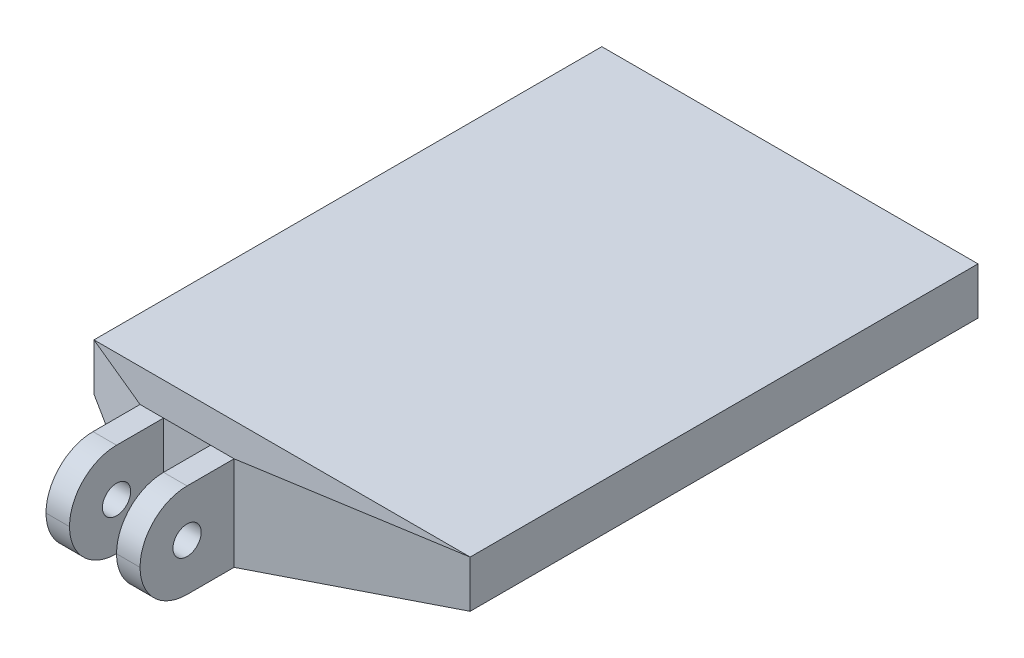
ISO-10303-21;
HEADER;
FILE_DESCRIPTION(('STEP AP214'),'2;1');
FILE_NAME('part.step','',(''),(''),'','','');
FILE_SCHEMA(('AUTOMOTIVE_DESIGN { 1 0 10303 214 1 1 1 1 }'));
ENDSEC;
DATA;
#1=APPLICATION_CONTEXT('core data for automotive mechanical design processes');
#2=APPLICATION_PROTOCOL_DEFINITION('international standard','automotive_design',2000,#1);
#3=PRODUCT_CONTEXT('',#1,'mechanical');
#4=PRODUCT('Part','Part','',(#3));
#5=PRODUCT_RELATED_PRODUCT_CATEGORY('part','',(#4));
#6=PRODUCT_DEFINITION_FORMATION('','',#4);
#7=PRODUCT_DEFINITION_CONTEXT('part definition',#1,'design');
#8=PRODUCT_DEFINITION('design','',#6,#7);
#9=PRODUCT_DEFINITION_SHAPE('','',#8);
#10=(LENGTH_UNIT() NAMED_UNIT(*) SI_UNIT(.MILLI.,.METRE.));
#11=(NAMED_UNIT(*) PLANE_ANGLE_UNIT() SI_UNIT($,.RADIAN.));
#12=(NAMED_UNIT(*) SI_UNIT($,.STERADIAN.) SOLID_ANGLE_UNIT());
#13=UNCERTAINTY_MEASURE_WITH_UNIT(LENGTH_MEASURE(1.E-05),#10,'distance_accuracy_value','');
#14=(GEOMETRIC_REPRESENTATION_CONTEXT(3) GLOBAL_UNCERTAINTY_ASSIGNED_CONTEXT((#13)) GLOBAL_UNIT_ASSIGNED_CONTEXT((#10,
#11,#12)) REPRESENTATION_CONTEXT('',''));
#15=CARTESIAN_POINT('',(0.,0.,0.));
#16=DIRECTION('',(0.,0.,1.));
#17=DIRECTION('',(1.,0.,0.));
#18=AXIS2_PLACEMENT_3D('',#15,#16,#17);
#19=CARTESIAN_POINT('',(0.,0.,31.));
#20=DIRECTION('',(0.,0.,1.));
#21=DIRECTION('',(1.,0.,0.));
#22=AXIS2_PLACEMENT_3D('',#19,#20,#21);
#23=PLANE('',#22);
#24=DIRECTION('',(1.,0.,0.));
#25=VECTOR('',#24,1.);
#26=CARTESIAN_POINT('',(-4.55,-2.5,31.));
#27=LINE('',#26,#25);
#28=CARTESIAN_POINT('',(-3.3,-2.5,31.));
#29=VERTEX_POINT('',#28);
#30=CARTESIAN_POINT('',(-0.800000000000001,-2.5,31.));
#31=VERTEX_POINT('',#30);
#32=EDGE_CURVE('E211',#29,#31,#27,.T.);
#33=ORIENTED_EDGE('',*,*,#32,.T.);
#34=DIRECTION('',(0.,-1.,0.));
#35=VECTOR('',#34,1.);
#36=CARTESIAN_POINT('',(-0.8,2.5,31.));
#37=LINE('',#36,#35);
#38=CARTESIAN_POINT('',(-0.800000000000001,2.5,31.));
#39=VERTEX_POINT('',#38);
#40=EDGE_CURVE('E218',#39,#31,#37,.T.);
#41=ORIENTED_EDGE('',*,*,#40,.F.);
#42=DIRECTION('',(-1.,0.,0.));
#43=VECTOR('',#42,1.);
#44=CARTESIAN_POINT('',(-4.55,2.5,31.));
#45=LINE('',#44,#43);
#46=CARTESIAN_POINT('',(-3.3,2.5,31.));
#47=VERTEX_POINT('',#46);
#48=EDGE_CURVE('E312',#39,#47,#45,.T.);
#49=ORIENTED_EDGE('',*,*,#48,.T.);
#50=DIRECTION('',(0.,1.,0.));
#51=VECTOR('',#50,1.);
#52=CARTESIAN_POINT('',(-3.3,2.5,31.));
#53=LINE('',#52,#51);
#54=EDGE_CURVE('E396',#29,#47,#53,.T.);
#55=ORIENTED_EDGE('',*,*,#54,.F.);
#56=EDGE_LOOP('',(#33,#41,#49,#55));
#57=FACE_BOUND('',#56,.T.);
#58=ADVANCED_FACE('F55',(#57),#23,.T.);
#59=CARTESIAN_POINT('',(10.,-1.25,28.));
#60=DIRECTION('',(-1.,0.,0.));
#61=DIRECTION('',(0.,0.,1.));
#62=AXIS2_PLACEMENT_3D('',#59,#60,#61);
#63=PLANE('',#62);
#64=DIRECTION('',(0.,0.,-1.));
#65=VECTOR('',#64,1.);
#66=CARTESIAN_POINT('',(10.,-1.25,28.));
#67=LINE('',#66,#65);
#68=CARTESIAN_POINT('',(10.,-1.25,28.));
#69=VERTEX_POINT('',#68);
#70=CARTESIAN_POINT('',(10.,-1.25,1.));
#71=VERTEX_POINT('',#70);
#72=EDGE_CURVE('E378',#69,#71,#67,.T.);
#73=ORIENTED_EDGE('',*,*,#72,.T.);
#74=DIRECTION('',(0.,1.,0.));
#75=VECTOR('',#74,1.);
#76=CARTESIAN_POINT('',(10.,1.25,1.));
#77=LINE('',#76,#75);
#78=CARTESIAN_POINT('',(10.,1.25,1.));
#79=VERTEX_POINT('',#78);
#80=EDGE_CURVE('E12',#71,#79,#77,.T.);
#81=ORIENTED_EDGE('',*,*,#80,.T.);
#82=DIRECTION('',(0.,0.,-1.));
#83=VECTOR('',#82,1.);
#84=CARTESIAN_POINT('',(10.,1.25,28.));
#85=LINE('',#84,#83);
#86=CARTESIAN_POINT('',(9.99999999999999,1.25,28.));
#87=VERTEX_POINT('',#86);
#88=EDGE_CURVE('E435',#87,#79,#85,.T.);
#89=ORIENTED_EDGE('',*,*,#88,.F.);
#90=DIRECTION('',(0.,1.,0.));
#91=VECTOR('',#90,1.);
#92=CARTESIAN_POINT('',(10.,0.,28.));
#93=LINE('',#92,#91);
#94=EDGE_CURVE('E538',#69,#87,#93,.T.);
#95=ORIENTED_EDGE('',*,*,#94,.F.);
#96=EDGE_LOOP('',(#73,#81,#89,#95));
#97=FACE_BOUND('',#96,.T.);
#98=ADVANCED_FACE('F361',(#97),#63,.F.);
#99=CARTESIAN_POINT('',(-10.,1.25,28.));
#100=DIRECTION('',(0.,-1.,0.));
#101=DIRECTION('',(0.,0.,-1.));
#102=AXIS2_PLACEMENT_3D('',#99,#100,#101);
#103=PLANE('',#102);
#104=ORIENTED_EDGE('',*,*,#88,.T.);
#105=DIRECTION('',(-1.,0.,0.));
#106=VECTOR('',#105,1.);
#107=CARTESIAN_POINT('',(-10.,1.25,1.));
#108=LINE('',#107,#106);
#109=CARTESIAN_POINT('',(-10.,1.25,1.));
#110=VERTEX_POINT('',#109);
#111=EDGE_CURVE('E567',#79,#110,#108,.T.);
#112=ORIENTED_EDGE('',*,*,#111,.T.);
#113=DIRECTION('',(0.,0.,-1.));
#114=VECTOR('',#113,1.);
#115=CARTESIAN_POINT('',(-10.,1.25,28.));
#116=LINE('',#115,#114);
#117=CARTESIAN_POINT('',(-9.99999999999999,1.25,28.));
#118=VERTEX_POINT('',#117);
#119=EDGE_CURVE('E441',#118,#110,#116,.T.);
#120=ORIENTED_EDGE('',*,*,#119,.F.);
#121=DIRECTION('',(1.,0.,0.));
#122=VECTOR('',#121,1.);
#123=CARTESIAN_POINT('',(0.,1.25,28.));
#124=LINE('',#123,#122);
#125=EDGE_CURVE('E536',#87,#118,#124,.F.);
#126=ORIENTED_EDGE('',*,*,#125,.F.);
#127=EDGE_LOOP('',(#104,#112,#120,#126));
#128=FACE_BOUND('',#127,.T.);
#129=ADVANCED_FACE('F366',(#128),#103,.F.);
#130=CARTESIAN_POINT('',(-10.,-1.25,28.));
#131=DIRECTION('',(1.,0.,0.));
#132=DIRECTION('',(0.,0.,-1.));
#133=AXIS2_PLACEMENT_3D('',#130,#131,#132);
#134=PLANE('',#133);
#135=ORIENTED_EDGE('',*,*,#119,.T.);
#136=DIRECTION('',(0.,-1.,0.));
#137=VECTOR('',#136,1.);
#138=CARTESIAN_POINT('',(-10.,-1.25,1.));
#139=LINE('',#138,#137);
#140=CARTESIAN_POINT('',(-10.,-1.25,1.));
#141=VERTEX_POINT('',#140);
#142=EDGE_CURVE('E81',#110,#141,#139,.T.);
#143=ORIENTED_EDGE('',*,*,#142,.T.);
#144=DIRECTION('',(0.,0.,-1.));
#145=VECTOR('',#144,1.);
#146=CARTESIAN_POINT('',(-10.,-1.25,28.));
#147=LINE('',#146,#145);
#148=CARTESIAN_POINT('',(-10.,-1.25,28.));
#149=VERTEX_POINT('',#148);
#150=EDGE_CURVE('E558',#149,#141,#147,.T.);
#151=ORIENTED_EDGE('',*,*,#150,.F.);
#152=DIRECTION('',(0.,1.,0.));
#153=VECTOR('',#152,1.);
#154=CARTESIAN_POINT('',(-10.,0.,28.));
#155=LINE('',#154,#153);
#156=EDGE_CURVE('E552',#118,#149,#155,.F.);
#157=ORIENTED_EDGE('',*,*,#156,.F.);
#158=EDGE_LOOP('',(#135,#143,#151,#157));
#159=FACE_BOUND('',#158,.T.);
#160=ADVANCED_FACE('F562',(#159),#134,.F.);
#161=CARTESIAN_POINT('',(-10.,-1.25,28.));
#162=DIRECTION('',(0.,1.,0.));
#163=DIRECTION('',(0.,0.,1.));
#164=AXIS2_PLACEMENT_3D('',#161,#162,#163);
#165=PLANE('',#164);
#166=ORIENTED_EDGE('',*,*,#150,.T.);
#167=DIRECTION('',(1.,0.,0.));
#168=VECTOR('',#167,1.);
#169=CARTESIAN_POINT('',(10.,-1.25,1.));
#170=LINE('',#169,#168);
#171=EDGE_CURVE('E66',#141,#71,#170,.T.);
#172=ORIENTED_EDGE('',*,*,#171,.T.);
#173=ORIENTED_EDGE('',*,*,#72,.F.);
#174=DIRECTION('',(1.,0.,0.));
#175=VECTOR('',#174,1.);
#176=CARTESIAN_POINT('',(0.,-1.25,28.));
#177=LINE('',#176,#175);
#178=EDGE_CURVE('E199',#149,#69,#177,.T.);
#179=ORIENTED_EDGE('',*,*,#178,.F.);
#180=EDGE_LOOP('',(#166,#172,#173,#179));
#181=FACE_BOUND('',#180,.T.);
#182=ADVANCED_FACE('F792',(#181),#165,.F.);
#183=CARTESIAN_POINT('',(0.,0.,0.));
#184=DIRECTION('',(0.,0.,-1.));
#185=DIRECTION('',(-1.,0.,0.));
#186=AXIS2_PLACEMENT_3D('',#183,#184,#185);
#187=PLANE('',#186);
#188=DIRECTION('',(0.,1.,0.));
#189=VECTOR('',#188,1.);
#190=CARTESIAN_POINT('',(-8.99999999999999,1.25,0.));
#191=LINE('',#190,#189);
#192=CARTESIAN_POINT('',(-8.99999999999999,-0.249999999999992,0.));
#193=VERTEX_POINT('',#192);
#194=CARTESIAN_POINT('',(-8.99999999999999,0.249999999999992,0.));
#195=VERTEX_POINT('',#194);
#196=EDGE_CURVE('E585',#193,#195,#191,.T.);
#197=ORIENTED_EDGE('',*,*,#196,.T.);
#198=DIRECTION('',(1.,0.,0.));
#199=VECTOR('',#198,1.);
#200=CARTESIAN_POINT('',(10.,0.249999999999992,0.));
#201=LINE('',#200,#199);
#202=CARTESIAN_POINT('',(8.99999999999999,0.249999999999992,0.));
#203=VERTEX_POINT('',#202);
#204=EDGE_CURVE('E588',#195,#203,#201,.T.);
#205=ORIENTED_EDGE('',*,*,#204,.T.);
#206=DIRECTION('',(0.,-1.,0.));
#207=VECTOR('',#206,1.);
#208=CARTESIAN_POINT('',(8.99999999999999,-1.25,0.));
#209=LINE('',#208,#207);
#210=CARTESIAN_POINT('',(8.99999999999999,-0.249999999999992,0.));
#211=VERTEX_POINT('',#210);
#212=EDGE_CURVE('E571',#203,#211,#209,.T.);
#213=ORIENTED_EDGE('',*,*,#212,.T.);
#214=DIRECTION('',(-1.,0.,0.));
#215=VECTOR('',#214,1.);
#216=CARTESIAN_POINT('',(-10.,-0.249999999999992,0.));
#217=LINE('',#216,#215);
#218=EDGE_CURVE('E575',#211,#193,#217,.T.);
#219=ORIENTED_EDGE('',*,*,#218,.T.);
#220=EDGE_LOOP('',(#197,#205,#213,#219));
#221=FACE_BOUND('',#220,.T.);
#222=ADVANCED_FACE('F292',(#221),#187,.T.);
#223=CARTESIAN_POINT('',(8.90396946183977,0.,28.3443027868566));
#224=DIRECTION('',(0.299696710543211,0.,0.954034528562556));
#225=DIRECTION('',(0.954034528562556,0.,-0.299696710543211));
#226=AXIS2_PLACEMENT_3D('',#223,#224,#225);
#227=PLANE('',#226);
#228=DIRECTION('',(0.946682073020697,0.123911266102185,-0.297387038645245));
#229=VECTOR('',#228,1.);
#230=CARTESIAN_POINT('',(0.450000000000001,-2.5,31.));
#231=LINE('',#230,#229);
#232=CARTESIAN_POINT('',(0.450000000000001,-2.5,31.));
#233=VERTEX_POINT('',#232);
#234=EDGE_CURVE('E192',#233,#69,#231,.T.);
#235=ORIENTED_EDGE('',*,*,#234,.T.);
#236=ORIENTED_EDGE('',*,*,#94,.T.);
#237=DIRECTION('',(0.946682073020697,-0.123911266102185,-0.297387038645245));
#238=VECTOR('',#237,1.);
#239=CARTESIAN_POINT('',(0.45,2.5,31.));
#240=LINE('',#239,#238);
#241=CARTESIAN_POINT('',(0.45,2.5,31.));
#242=VERTEX_POINT('',#241);
#243=EDGE_CURVE('E203',#242,#87,#240,.T.);
#244=ORIENTED_EDGE('',*,*,#243,.F.);
#245=DIRECTION('',(0.,1.,0.));
#246=VECTOR('',#245,1.);
#247=CARTESIAN_POINT('',(0.45,2.5,31.));
#248=LINE('',#247,#246);
#249=EDGE_CURVE('E177',#233,#242,#248,.T.);
#250=ORIENTED_EDGE('',*,*,#249,.F.);
#251=EDGE_LOOP('',(#235,#236,#244,#250));
#252=FACE_BOUND('',#251,.T.);
#253=ADVANCED_FACE('F207',(#252),#227,.T.);
#254=CARTESIAN_POINT('',(0.,-8.87573964497042,3.69822485207101));
#255=DIRECTION('',(0.,0.923076923076923,-0.384615384615385));
#256=DIRECTION('',(0.,0.384615384615385,0.923076923076923));
#257=AXIS2_PLACEMENT_3D('',#254,#255,#256);
#258=PLANE('',#257);
#259=ORIENTED_EDGE('',*,*,#243,.T.);
#260=ORIENTED_EDGE('',*,*,#125,.T.);
#261=DIRECTION('',(-0.858880317897595,-0.196990898600366,-0.472778156640878));
#262=VECTOR('',#261,1.);
#263=CARTESIAN_POINT('',(-4.55,2.5,31.));
#264=LINE('',#263,#262);
#265=CARTESIAN_POINT('',(-4.55,2.5,31.));
#266=VERTEX_POINT('',#265);
#267=EDGE_CURVE('E534',#266,#118,#264,.T.);
#268=ORIENTED_EDGE('',*,*,#267,.F.);
#269=CARTESIAN_POINT('',(-3.3,2.5,31.));
#270=DIRECTION('',(-1.,0.,0.));
#271=VECTOR('',#270,1.);
#272=LINE('',#269,#271);
#273=EDGE_CURVE('E401',#47,#266,#272,.T.);
#274=ORIENTED_EDGE('',*,*,#273,.F.);
#275=ORIENTED_EDGE('',*,*,#48,.F.);
#276=EDGE_CURVE('E204',#242,#39,#45,.T.);
#277=ORIENTED_EDGE('',*,*,#276,.F.);
#278=EDGE_LOOP('',(#259,#260,#268,#274,#275,#277));
#279=FACE_BOUND('',#278,.T.);
#280=ADVANCED_FACE('F284',(#279),#258,.T.);
#281=CARTESIAN_POINT('',(0.,8.87573964497042,3.69822485207101));
#282=DIRECTION('',(0.,-0.923076923076923,-0.384615384615385));
#283=DIRECTION('',(0.,0.384615384615385,-0.923076923076923));
#284=AXIS2_PLACEMENT_3D('',#281,#282,#283);
#285=PLANE('',#284);
#286=DIRECTION('',(-0.858880317897595,0.196990898600366,-0.472778156640878));
#287=VECTOR('',#286,1.);
#288=CARTESIAN_POINT('',(-4.55,-2.5,31.));
#289=LINE('',#288,#287);
#290=CARTESIAN_POINT('',(-4.55,-2.5,31.));
#291=VERTEX_POINT('',#290);
#292=EDGE_CURVE('E270',#291,#149,#289,.T.);
#293=ORIENTED_EDGE('',*,*,#292,.T.);
#294=ORIENTED_EDGE('',*,*,#178,.T.);
#295=ORIENTED_EDGE('',*,*,#234,.F.);
#296=CARTESIAN_POINT('',(-0.8,-2.5,31.));
#297=DIRECTION('',(1.,0.,0.));
#298=VECTOR('',#297,1.);
#299=LINE('',#296,#298);
#300=EDGE_CURVE('E185',#31,#233,#299,.T.);
#301=ORIENTED_EDGE('',*,*,#300,.F.);
#302=ORIENTED_EDGE('',*,*,#32,.F.);
#303=EDGE_CURVE('E475',#291,#29,#27,.T.);
#304=ORIENTED_EDGE('',*,*,#303,.F.);
#305=EDGE_LOOP('',(#293,#294,#295,#301,#302,#304));
#306=FACE_BOUND('',#305,.T.);
#307=ADVANCED_FACE('F194',(#306),#285,.T.);
#308=CARTESIAN_POINT('',(-14.1541244105678,0.,25.7133260125315));
#309=DIRECTION('',(-0.482227246606493,0.,0.876046164668461));
#310=DIRECTION('',(0.876046164668461,0.,0.482227246606493));
#311=AXIS2_PLACEMENT_3D('',#308,#309,#310);
#312=PLANE('',#311);
#313=ORIENTED_EDGE('',*,*,#267,.T.);
#314=ORIENTED_EDGE('',*,*,#156,.T.);
#315=ORIENTED_EDGE('',*,*,#292,.F.);
#316=DIRECTION('',(0.,-1.,0.));
#317=VECTOR('',#316,1.);
#318=CARTESIAN_POINT('',(-4.55,2.5,31.));
#319=LINE('',#318,#317);
#320=EDGE_CURVE('E424',#266,#291,#319,.T.);
#321=ORIENTED_EDGE('',*,*,#320,.F.);
#322=EDGE_LOOP('',(#313,#314,#315,#321));
#323=FACE_BOUND('',#322,.T.);
#324=ADVANCED_FACE('F283',(#323),#312,.T.);
#325=CARTESIAN_POINT('',(-4.55,2.5,36.));
#326=DIRECTION('',(1.,0.,0.));
#327=DIRECTION('',(0.,1.,0.));
#328=AXIS2_PLACEMENT_3D('',#325,#326,#327);
#329=PLANE('',#328);
#330=CARTESIAN_POINT('',(-4.55,0.,33.5));
#331=DIRECTION('',(1.,0.,0.));
#332=DIRECTION('',(0.,1.,0.));
#333=AXIS2_PLACEMENT_3D('',#330,#331,#332);
#334=CIRCLE('',#333,0.749999999999999);
#335=CARTESIAN_POINT('',(-4.55,0.749999999999999,33.5));
#336=VERTEX_POINT('',#335);
#337=EDGE_CURVE('E407',#336,#336,#334,.T.);
#338=ORIENTED_EDGE('',*,*,#337,.T.);
#339=EDGE_LOOP('',(#338));
#340=FACE_BOUND('',#339,.T.);
#341=DIRECTION('',(0.,0.,-1.));
#342=VECTOR('',#341,1.);
#343=CARTESIAN_POINT('',(-4.55,-2.5,36.));
#344=LINE('',#343,#342);
#345=CARTESIAN_POINT('',(-4.55,-2.5,33.5));
#346=VERTEX_POINT('',#345);
#347=EDGE_CURVE('E212',#346,#291,#344,.T.);
#348=ORIENTED_EDGE('',*,*,#347,.F.);
#349=CARTESIAN_POINT('',(-4.55,0.,33.5));
#350=DIRECTION('',(1.,0.,0.));
#351=DIRECTION('',(0.,1.,0.));
#352=AXIS2_PLACEMENT_3D('',#349,#350,#351);
#353=CIRCLE('',#352,2.5);
#354=CARTESIAN_POINT('',(-4.55,0.,36.));
#355=VERTEX_POINT('',#354);
#356=EDGE_CURVE('E503',#346,#355,#353,.F.);
#357=ORIENTED_EDGE('',*,*,#356,.T.);
#358=CARTESIAN_POINT('',(-4.55,0.,33.5));
#359=DIRECTION('',(1.,0.,0.));
#360=DIRECTION('',(0.,1.,0.));
#361=AXIS2_PLACEMENT_3D('',#358,#359,#360);
#362=CIRCLE('',#361,2.5);
#363=CARTESIAN_POINT('',(-4.55,2.5,33.5));
#364=VERTEX_POINT('',#363);
#365=EDGE_CURVE('E505',#355,#364,#362,.F.);
#366=ORIENTED_EDGE('',*,*,#365,.T.);
#367=DIRECTION('',(0.,0.,-1.));
#368=VECTOR('',#367,1.);
#369=CARTESIAN_POINT('',(-4.55,2.5,36.));
#370=LINE('',#369,#368);
#371=EDGE_CURVE('E466',#364,#266,#370,.T.);
#372=ORIENTED_EDGE('',*,*,#371,.T.);
#373=ORIENTED_EDGE('',*,*,#320,.T.);
#374=EDGE_LOOP('',(#348,#357,#366,#372,#373));
#375=FACE_BOUND('',#374,.T.);
#376=ADVANCED_FACE('F290',(#340,#375),#329,.F.);
#377=CARTESIAN_POINT('',(-4.55,-2.5,36.));
#378=DIRECTION('',(0.,1.,0.));
#379=DIRECTION('',(0.,0.,1.));
#380=AXIS2_PLACEMENT_3D('',#377,#378,#379);
#381=PLANE('',#380);
#382=DIRECTION('',(0.,0.,-1.));
#383=VECTOR('',#382,1.);
#384=CARTESIAN_POINT('',(-3.3,-2.5,36.));
#385=LINE('',#384,#383);
#386=CARTESIAN_POINT('',(-3.3,-2.5,33.5));
#387=VERTEX_POINT('',#386);
#388=EDGE_CURVE('E465',#387,#29,#385,.T.);
#389=ORIENTED_EDGE('',*,*,#388,.F.);
#390=DIRECTION('',(1.,0.,0.));
#391=VECTOR('',#390,1.);
#392=CARTESIAN_POINT('',(-4.55,-2.5,33.5));
#393=LINE('',#392,#391);
#394=EDGE_CURVE('E496',#387,#346,#393,.F.);
#395=ORIENTED_EDGE('',*,*,#394,.T.);
#396=ORIENTED_EDGE('',*,*,#347,.T.);
#397=ORIENTED_EDGE('',*,*,#303,.T.);
#398=EDGE_LOOP('',(#389,#395,#396,#397));
#399=FACE_BOUND('',#398,.T.);
#400=ADVANCED_FACE('F480',(#399),#381,.F.);
#401=CARTESIAN_POINT('',(-3.3,2.5,36.));
#402=DIRECTION('',(-1.,0.,0.));
#403=DIRECTION('',(0.,0.,1.));
#404=AXIS2_PLACEMENT_3D('',#401,#402,#403);
#405=PLANE('',#404);
#406=CARTESIAN_POINT('',(-3.3,0.,33.5));
#407=DIRECTION('',(-1.,0.,0.));
#408=DIRECTION('',(0.,0.,1.));
#409=AXIS2_PLACEMENT_3D('',#406,#407,#408);
#410=CIRCLE('',#409,0.749999999999999);
#411=CARTESIAN_POINT('',(-3.3,0.,34.25));
#412=VERTEX_POINT('',#411);
#413=EDGE_CURVE('E620',#412,#412,#410,.T.);
#414=ORIENTED_EDGE('',*,*,#413,.T.);
#415=EDGE_LOOP('',(#414));
#416=FACE_BOUND('',#415,.T.);
#417=CARTESIAN_POINT('',(-3.3,0.,33.5));
#418=DIRECTION('',(-1.,0.,0.));
#419=DIRECTION('',(0.,0.,1.));
#420=AXIS2_PLACEMENT_3D('',#417,#418,#419);
#421=CIRCLE('',#420,2.5);
#422=CARTESIAN_POINT('',(-3.3,2.5,33.5));
#423=VERTEX_POINT('',#422);
#424=CARTESIAN_POINT('',(-3.3,0.,36.));
#425=VERTEX_POINT('',#424);
#426=EDGE_CURVE('E461',#423,#425,#421,.F.);
#427=ORIENTED_EDGE('',*,*,#426,.T.);
#428=CARTESIAN_POINT('',(-3.3,0.,33.5));
#429=DIRECTION('',(-1.,0.,0.));
#430=DIRECTION('',(0.,0.,1.));
#431=AXIS2_PLACEMENT_3D('',#428,#429,#430);
#432=CIRCLE('',#431,2.5);
#433=EDGE_CURVE('E502',#425,#387,#432,.F.);
#434=ORIENTED_EDGE('',*,*,#433,.T.);
#435=ORIENTED_EDGE('',*,*,#388,.T.);
#436=ORIENTED_EDGE('',*,*,#54,.T.);
#437=DIRECTION('',(0.,0.,-1.));
#438=VECTOR('',#437,1.);
#439=CARTESIAN_POINT('',(-3.3,2.5,36.));
#440=LINE('',#439,#438);
#441=EDGE_CURVE('E462',#423,#47,#440,.T.);
#442=ORIENTED_EDGE('',*,*,#441,.F.);
#443=EDGE_LOOP('',(#427,#434,#435,#436,#442));
#444=FACE_BOUND('',#443,.T.);
#445=ADVANCED_FACE('F245',(#416,#444),#405,.F.);
#446=CARTESIAN_POINT('',(-4.55,2.5,36.));
#447=DIRECTION('',(0.,-1.,0.));
#448=DIRECTION('',(0.,0.,-1.));
#449=AXIS2_PLACEMENT_3D('',#446,#447,#448);
#450=PLANE('',#449);
#451=ORIENTED_EDGE('',*,*,#371,.F.);
#452=DIRECTION('',(-1.,0.,0.));
#453=VECTOR('',#452,1.);
#454=CARTESIAN_POINT('',(-3.3,2.5,33.5));
#455=LINE('',#454,#453);
#456=EDGE_CURVE('E577',#364,#423,#455,.F.);
#457=ORIENTED_EDGE('',*,*,#456,.T.);
#458=ORIENTED_EDGE('',*,*,#441,.T.);
#459=ORIENTED_EDGE('',*,*,#273,.T.);
#460=EDGE_LOOP('',(#451,#457,#458,#459));
#461=FACE_BOUND('',#460,.T.);
#462=ADVANCED_FACE('F241',(#461),#450,.F.);
#463=CARTESIAN_POINT('',(0.45,2.5,36.));
#464=DIRECTION('',(-1.,0.,0.));
#465=DIRECTION('',(0.,-1.,0.));
#466=AXIS2_PLACEMENT_3D('',#463,#464,#465);
#467=PLANE('',#466);
#468=CARTESIAN_POINT('',(0.45,0.,33.5));
#469=DIRECTION('',(1.,0.,0.));
#470=DIRECTION('',(0.,0.,-1.));
#471=AXIS2_PLACEMENT_3D('',#468,#469,#470);
#472=CIRCLE('',#471,0.749999999999999);
#473=CARTESIAN_POINT('',(0.45,0.,32.75));
#474=VERTEX_POINT('',#473);
#475=EDGE_CURVE('E609',#474,#474,#472,.T.);
#476=ORIENTED_EDGE('',*,*,#475,.F.);
#477=EDGE_LOOP('',(#476));
#478=FACE_BOUND('',#477,.T.);
#479=CARTESIAN_POINT('',(0.45,0.,33.5));
#480=DIRECTION('',(-1.,0.,0.));
#481=DIRECTION('',(0.,-1.,0.));
#482=AXIS2_PLACEMENT_3D('',#479,#480,#481);
#483=CIRCLE('',#482,2.5);
#484=CARTESIAN_POINT('',(0.45,2.5,33.5));
#485=VERTEX_POINT('',#484);
#486=CARTESIAN_POINT('',(0.45,0.,36.));
#487=VERTEX_POINT('',#486);
#488=EDGE_CURVE('E429',#485,#487,#483,.F.);
#489=ORIENTED_EDGE('',*,*,#488,.T.);
#490=CARTESIAN_POINT('',(0.45,0.,33.5));
#491=DIRECTION('',(-1.,0.,0.));
#492=DIRECTION('',(0.,-1.,0.));
#493=AXIS2_PLACEMENT_3D('',#490,#491,#492);
#494=CIRCLE('',#493,2.5);
#495=CARTESIAN_POINT('',(0.450000000000001,-2.5,33.5));
#496=VERTEX_POINT('',#495);
#497=EDGE_CURVE('E179',#487,#496,#494,.F.);
#498=ORIENTED_EDGE('',*,*,#497,.T.);
#499=DIRECTION('',(0.,0.,-1.));
#500=VECTOR('',#499,1.);
#501=CARTESIAN_POINT('',(0.450000000000001,-2.5,36.));
#502=LINE('',#501,#500);
#503=EDGE_CURVE('E172',#496,#233,#502,.T.);
#504=ORIENTED_EDGE('',*,*,#503,.T.);
#505=ORIENTED_EDGE('',*,*,#249,.T.);
#506=DIRECTION('',(0.,0.,-1.));
#507=VECTOR('',#506,1.);
#508=CARTESIAN_POINT('',(0.45,2.5,36.));
#509=LINE('',#508,#507);
#510=EDGE_CURVE('E321',#485,#242,#509,.T.);
#511=ORIENTED_EDGE('',*,*,#510,.F.);
#512=EDGE_LOOP('',(#489,#498,#504,#505,#511));
#513=FACE_BOUND('',#512,.T.);
#514=ADVANCED_FACE('F174',(#478,#513),#467,.F.);
#515=CARTESIAN_POINT('',(0.45,2.5,36.));
#516=DIRECTION('',(0.,-1.,0.));
#517=DIRECTION('',(1.,0.,0.));
#518=AXIS2_PLACEMENT_3D('',#515,#516,#517);
#519=PLANE('',#518);
#520=DIRECTION('',(0.,0.,-1.));
#521=VECTOR('',#520,1.);
#522=CARTESIAN_POINT('',(-0.8,2.5,36.));
#523=LINE('',#522,#521);
#524=CARTESIAN_POINT('',(-0.8,2.5,33.5));
#525=VERTEX_POINT('',#524);
#526=EDGE_CURVE('E324',#525,#39,#523,.T.);
#527=ORIENTED_EDGE('',*,*,#526,.F.);
#528=DIRECTION('',(-1.,0.,0.));
#529=VECTOR('',#528,1.);
#530=CARTESIAN_POINT('',(0.45,2.5,33.5));
#531=LINE('',#530,#529);
#532=EDGE_CURVE('E427',#525,#485,#531,.F.);
#533=ORIENTED_EDGE('',*,*,#532,.T.);
#534=ORIENTED_EDGE('',*,*,#510,.T.);
#535=ORIENTED_EDGE('',*,*,#276,.T.);
#536=EDGE_LOOP('',(#527,#533,#534,#535));
#537=FACE_BOUND('',#536,.T.);
#538=ADVANCED_FACE('F332',(#537),#519,.F.);
#539=CARTESIAN_POINT('',(-0.8,2.5,36.));
#540=DIRECTION('',(1.,0.,0.));
#541=DIRECTION('',(0.,1.,0.));
#542=AXIS2_PLACEMENT_3D('',#539,#540,#541);
#543=PLANE('',#542);
#544=CARTESIAN_POINT('',(-0.8,0.,33.5));
#545=DIRECTION('',(1.,0.,0.));
#546=DIRECTION('',(0.,1.,0.));
#547=AXIS2_PLACEMENT_3D('',#544,#545,#546);
#548=CIRCLE('',#547,0.749999999999999);
#549=CARTESIAN_POINT('',(-0.8,0.749999999999999,33.5));
#550=VERTEX_POINT('',#549);
#551=EDGE_CURVE('E580',#550,#550,#548,.T.);
#552=ORIENTED_EDGE('',*,*,#551,.T.);
#553=EDGE_LOOP('',(#552));
#554=FACE_BOUND('',#553,.T.);
#555=DIRECTION('',(0.,0.,-1.));
#556=VECTOR('',#555,1.);
#557=CARTESIAN_POINT('',(-0.8,-2.5,36.));
#558=LINE('',#557,#556);
#559=CARTESIAN_POINT('',(-0.8,-2.5,33.5));
#560=VERTEX_POINT('',#559);
#561=EDGE_CURVE('E186',#560,#31,#558,.T.);
#562=ORIENTED_EDGE('',*,*,#561,.F.);
#563=CARTESIAN_POINT('',(-0.8,0.,33.5));
#564=DIRECTION('',(1.,0.,0.));
#565=DIRECTION('',(0.,1.,0.));
#566=AXIS2_PLACEMENT_3D('',#563,#564,#565);
#567=CIRCLE('',#566,2.5);
#568=CARTESIAN_POINT('',(-0.8,0.,36.));
#569=VERTEX_POINT('',#568);
#570=EDGE_CURVE('E458',#560,#569,#567,.F.);
#571=ORIENTED_EDGE('',*,*,#570,.T.);
#572=CARTESIAN_POINT('',(-0.8,0.,33.5));
#573=DIRECTION('',(1.,0.,0.));
#574=DIRECTION('',(0.,1.,0.));
#575=AXIS2_PLACEMENT_3D('',#572,#573,#574);
#576=CIRCLE('',#575,2.5);
#577=EDGE_CURVE('E452',#569,#525,#576,.F.);
#578=ORIENTED_EDGE('',*,*,#577,.T.);
#579=ORIENTED_EDGE('',*,*,#526,.T.);
#580=ORIENTED_EDGE('',*,*,#40,.T.);
#581=EDGE_LOOP('',(#562,#571,#578,#579,#580));
#582=FACE_BOUND('',#581,.T.);
#583=ADVANCED_FACE('F239',(#554,#582),#543,.F.);
#584=CARTESIAN_POINT('',(0.450000000000001,-2.5,36.));
#585=DIRECTION('',(0.,1.,0.));
#586=DIRECTION('',(0.,0.,1.));
#587=AXIS2_PLACEMENT_3D('',#584,#585,#586);
#588=PLANE('',#587);
#589=ORIENTED_EDGE('',*,*,#503,.F.);
#590=DIRECTION('',(1.,0.,0.));
#591=VECTOR('',#590,1.);
#592=CARTESIAN_POINT('',(0.450000000000001,-2.5,33.5));
#593=LINE('',#592,#591);
#594=EDGE_CURVE('E438',#496,#560,#593,.F.);
#595=ORIENTED_EDGE('',*,*,#594,.T.);
#596=ORIENTED_EDGE('',*,*,#561,.T.);
#597=ORIENTED_EDGE('',*,*,#300,.T.);
#598=EDGE_LOOP('',(#589,#595,#596,#597));
#599=FACE_BOUND('',#598,.T.);
#600=ADVANCED_FACE('F215',(#599),#588,.F.);
#601=CARTESIAN_POINT('',(0.,0.,33.5));
#602=DIRECTION('',(-1.,0.,0.));
#603=DIRECTION('',(0.,-1.,0.));
#604=AXIS2_PLACEMENT_3D('',#601,#602,#603);
#605=CYLINDRICAL_SURFACE('',#604,2.5);
#606=ORIENTED_EDGE('',*,*,#532,.F.);
#607=ORIENTED_EDGE('',*,*,#577,.F.);
#608=DIRECTION('',(-1.,0.,0.));
#609=VECTOR('',#608,1.);
#610=CARTESIAN_POINT('',(0.,0.,36.));
#611=LINE('',#610,#609);
#612=EDGE_CURVE('E325',#487,#569,#611,.T.);
#613=ORIENTED_EDGE('',*,*,#612,.F.);
#614=ORIENTED_EDGE('',*,*,#488,.F.);
#615=EDGE_LOOP('',(#606,#607,#613,#614));
#616=FACE_BOUND('',#615,.T.);
#617=ADVANCED_FACE('F238',(#616),#605,.T.);
#618=CARTESIAN_POINT('',(0.,0.,33.5));
#619=DIRECTION('',(1.,0.,0.));
#620=DIRECTION('',(0.,0.,-1.));
#621=AXIS2_PLACEMENT_3D('',#618,#619,#620);
#622=CYLINDRICAL_SURFACE('',#621,2.5);
#623=ORIENTED_EDGE('',*,*,#570,.F.);
#624=ORIENTED_EDGE('',*,*,#594,.F.);
#625=ORIENTED_EDGE('',*,*,#497,.F.);
#626=ORIENTED_EDGE('',*,*,#612,.T.);
#627=EDGE_LOOP('',(#623,#624,#625,#626));
#628=FACE_BOUND('',#627,.T.);
#629=ADVANCED_FACE('F641',(#628),#622,.T.);
#630=CARTESIAN_POINT('',(0.,0.,33.5));
#631=DIRECTION('',(1.,0.,0.));
#632=DIRECTION('',(0.,0.,-1.));
#633=AXIS2_PLACEMENT_3D('',#630,#631,#632);
#634=CYLINDRICAL_SURFACE('',#633,2.5);
#635=ORIENTED_EDGE('',*,*,#456,.F.);
#636=ORIENTED_EDGE('',*,*,#365,.F.);
#637=DIRECTION('',(-1.,0.,0.));
#638=VECTOR('',#637,1.);
#639=CARTESIAN_POINT('',(-4.55,0.,36.));
#640=LINE('',#639,#638);
#641=EDGE_CURVE('E625',#425,#355,#640,.T.);
#642=ORIENTED_EDGE('',*,*,#641,.F.);
#643=ORIENTED_EDGE('',*,*,#426,.F.);
#644=EDGE_LOOP('',(#635,#636,#642,#643));
#645=FACE_BOUND('',#644,.T.);
#646=ADVANCED_FACE('F636',(#645),#634,.T.);
#647=CARTESIAN_POINT('',(0.,0.,33.5));
#648=DIRECTION('',(-1.,0.,0.));
#649=DIRECTION('',(0.,0.,1.));
#650=AXIS2_PLACEMENT_3D('',#647,#648,#649);
#651=CYLINDRICAL_SURFACE('',#650,2.5);
#652=ORIENTED_EDGE('',*,*,#356,.F.);
#653=ORIENTED_EDGE('',*,*,#394,.F.);
#654=ORIENTED_EDGE('',*,*,#433,.F.);
#655=ORIENTED_EDGE('',*,*,#641,.T.);
#656=EDGE_LOOP('',(#652,#653,#654,#655));
#657=FACE_BOUND('',#656,.T.);
#658=ADVANCED_FACE('F356',(#657),#651,.T.);
#659=CARTESIAN_POINT('',(-10.000025,0.,33.5));
#660=DIRECTION('',(1.,0.,0.));
#661=DIRECTION('',(0.,0.,-1.));
#662=AXIS2_PLACEMENT_3D('',#659,#660,#661);
#663=CYLINDRICAL_SURFACE('',#662,0.749999999999999);
#664=ORIENTED_EDGE('',*,*,#475,.T.);
#665=EDGE_LOOP('',(#664));
#666=FACE_BOUND('',#665,.T.);
#667=ORIENTED_EDGE('',*,*,#551,.F.);
#668=EDGE_LOOP('',(#667));
#669=FACE_BOUND('',#668,.T.);
#670=ADVANCED_FACE('F347',(#666,#669),#663,.F.);
#671=ORIENTED_EDGE('',*,*,#413,.F.);
#672=EDGE_LOOP('',(#671));
#673=FACE_BOUND('',#672,.T.);
#674=ORIENTED_EDGE('',*,*,#337,.F.);
#675=EDGE_LOOP('',(#674));
#676=FACE_BOUND('',#675,.T.);
#677=ADVANCED_FACE('F345',(#673,#676),#663,.F.);
#678=CARTESIAN_POINT('',(-10.,-1.25,1.));
#679=DIRECTION('',(0.,-0.707106781186546,-0.707106781186549));
#680=DIRECTION('',(-1.,0.,0.));
#681=AXIS2_PLACEMENT_3D('',#678,#679,#680);
#682=PLANE('',#681);
#683=DIRECTION('',(0.577350269189626,0.577350269189626,-0.577350269189624));
#684=VECTOR('',#683,1.);
#685=CARTESIAN_POINT('',(-10.,-1.25,1.));
#686=LINE('',#685,#684);
#687=EDGE_CURVE('E601',#193,#141,#686,.F.);
#688=ORIENTED_EDGE('',*,*,#687,.F.);
#689=ORIENTED_EDGE('',*,*,#218,.F.);
#690=DIRECTION('',(-0.577350269189626,0.577350269189626,-0.577350269189624));
#691=VECTOR('',#690,1.);
#692=CARTESIAN_POINT('',(10.,-1.25,1.));
#693=LINE('',#692,#691);
#694=EDGE_CURVE('E60',#71,#211,#693,.T.);
#695=ORIENTED_EDGE('',*,*,#694,.F.);
#696=ORIENTED_EDGE('',*,*,#171,.F.);
#697=EDGE_LOOP('',(#688,#689,#695,#696));
#698=FACE_BOUND('',#697,.T.);
#699=ADVANCED_FACE('F58',(#698),#682,.T.);
#700=CARTESIAN_POINT('',(10.,-1.25,1.));
#701=DIRECTION('',(0.707106781186546,0.,-0.707106781186549));
#702=DIRECTION('',(0.,-1.,0.));
#703=AXIS2_PLACEMENT_3D('',#700,#701,#702);
#704=PLANE('',#703);
#705=ORIENTED_EDGE('',*,*,#694,.T.);
#706=ORIENTED_EDGE('',*,*,#212,.F.);
#707=DIRECTION('',(0.577350269189626,0.577350269189626,0.577350269189624));
#708=VECTOR('',#707,1.);
#709=CARTESIAN_POINT('',(9.16666666666667,0.416666666666665,0.166666666666672));
#710=LINE('',#709,#708);
#711=EDGE_CURVE('E599',#79,#203,#710,.F.);
#712=ORIENTED_EDGE('',*,*,#711,.F.);
#713=ORIENTED_EDGE('',*,*,#80,.F.);
#714=EDGE_LOOP('',(#705,#706,#712,#713));
#715=FACE_BOUND('',#714,.T.);
#716=ADVANCED_FACE('F354',(#715),#704,.T.);
#717=CARTESIAN_POINT('',(-10.,-1.25,1.));
#718=DIRECTION('',(-0.707106781186546,0.,-0.707106781186549));
#719=DIRECTION('',(0.,1.,0.));
#720=AXIS2_PLACEMENT_3D('',#717,#718,#719);
#721=PLANE('',#720);
#722=ORIENTED_EDGE('',*,*,#687,.T.);
#723=ORIENTED_EDGE('',*,*,#142,.F.);
#724=DIRECTION('',(0.577350269189626,-0.577350269189626,-0.577350269189624));
#725=VECTOR('',#724,1.);
#726=CARTESIAN_POINT('',(-9.16666666666666,0.416666666666665,0.166666666666672));
#727=LINE('',#726,#725);
#728=EDGE_CURVE('E596',#195,#110,#727,.F.);
#729=ORIENTED_EDGE('',*,*,#728,.F.);
#730=ORIENTED_EDGE('',*,*,#196,.F.);
#731=EDGE_LOOP('',(#722,#723,#729,#730));
#732=FACE_BOUND('',#731,.T.);
#733=ADVANCED_FACE('F661',(#732),#721,.T.);
#734=CARTESIAN_POINT('',(-10.,1.25,1.));
#735=DIRECTION('',(0.,0.707106781186546,-0.707106781186549));
#736=DIRECTION('',(1.,0.,0.));
#737=AXIS2_PLACEMENT_3D('',#734,#735,#736);
#738=PLANE('',#737);
#739=ORIENTED_EDGE('',*,*,#711,.T.);
#740=ORIENTED_EDGE('',*,*,#204,.F.);
#741=ORIENTED_EDGE('',*,*,#728,.T.);
#742=ORIENTED_EDGE('',*,*,#111,.F.);
#743=EDGE_LOOP('',(#739,#740,#741,#742));
#744=FACE_BOUND('',#743,.T.);
#745=ADVANCED_FACE('F655',(#744),#738,.T.);
#746=CLOSED_SHELL('',(#58,#98,#129,#160,#182,#222,#253,#280,#307,#324,#376,#400,#445,#462,#514,
#538,#583,#600,#617,#629,#646,#658,#670,#677,#699,#716,#733,#745));
#747=MANIFOLD_SOLID_BREP('B2',#746);
#748=ADVANCED_BREP_SHAPE_REPRESENTATION('',(#18,#747),#14);
#749=SHAPE_DEFINITION_REPRESENTATION(#9,#748);
ENDSEC;
END-ISO-10303-21;
